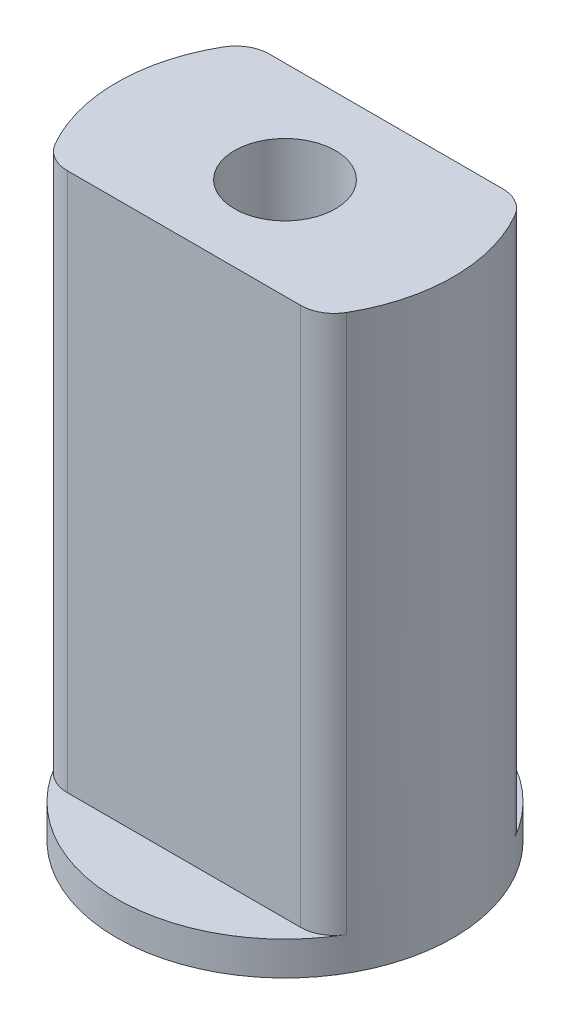
ISO-10303-21;
HEADER;
FILE_DESCRIPTION(('STEP AP214'),'2;1');
FILE_NAME('part.step','',(''),(''),'','','');
FILE_SCHEMA(('AUTOMOTIVE_DESIGN { 1 0 10303 214 1 1 1 1 }'));
ENDSEC;
DATA;
#1=APPLICATION_CONTEXT('core data for automotive mechanical design processes');
#2=APPLICATION_PROTOCOL_DEFINITION('international standard','automotive_design',2000,#1);
#3=PRODUCT_CONTEXT('',#1,'mechanical');
#4=PRODUCT('Part','Part','',(#3));
#5=PRODUCT_RELATED_PRODUCT_CATEGORY('part','',(#4));
#6=PRODUCT_DEFINITION_FORMATION('','',#4);
#7=PRODUCT_DEFINITION_CONTEXT('part definition',#1,'design');
#8=PRODUCT_DEFINITION('design','',#6,#7);
#9=PRODUCT_DEFINITION_SHAPE('','',#8);
#10=(LENGTH_UNIT() NAMED_UNIT(*) SI_UNIT(.MILLI.,.METRE.));
#11=(NAMED_UNIT(*) PLANE_ANGLE_UNIT() SI_UNIT($,.RADIAN.));
#12=(NAMED_UNIT(*) SI_UNIT($,.STERADIAN.) SOLID_ANGLE_UNIT());
#13=UNCERTAINTY_MEASURE_WITH_UNIT(LENGTH_MEASURE(1.E-05),#10,'distance_accuracy_value','');
#14=(GEOMETRIC_REPRESENTATION_CONTEXT(3) GLOBAL_UNCERTAINTY_ASSIGNED_CONTEXT((#13)) GLOBAL_UNIT_ASSIGNED_CONTEXT((#10,
#11,#12)) REPRESENTATION_CONTEXT('',''));
#15=CARTESIAN_POINT('',(0.,0.,0.));
#16=DIRECTION('',(0.,0.,1.));
#17=DIRECTION('',(1.,0.,0.));
#18=AXIS2_PLACEMENT_3D('',#15,#16,#17);
#19=CARTESIAN_POINT('',(0.,0.5,0.));
#20=DIRECTION('',(0.,1.,0.));
#21=DIRECTION('',(0.,0.,1.));
#22=AXIS2_PLACEMENT_3D('',#19,#20,#21);
#23=PLANE('',#22);
#24=CARTESIAN_POINT('',(0.,0.5,0.));
#25=DIRECTION('',(0.,1.,0.));
#26=DIRECTION('',(0.,0.,1.));
#27=AXIS2_PLACEMENT_3D('',#24,#25,#26);
#28=CIRCLE('',#27,2.5);
#29=CARTESIAN_POINT('',(2.1650635094611,0.5,-1.25));
#30=VERTEX_POINT('',#29);
#31=CARTESIAN_POINT('',(-2.1650635094611,0.5,-1.25));
#32=VERTEX_POINT('',#31);
#33=EDGE_CURVE('E131',#30,#32,#28,.T.);
#34=ORIENTED_EDGE('',*,*,#33,.T.);
#35=CARTESIAN_POINT('',(-1.73205080756888,0.5,-1.));
#36=DIRECTION('',(0.,1.,0.));
#37=DIRECTION('',(0.,0.,1.));
#38=AXIS2_PLACEMENT_3D('',#35,#36,#37);
#39=CIRCLE('',#38,0.5);
#40=CARTESIAN_POINT('',(-1.73205080756888,0.5,-1.5));
#41=VERTEX_POINT('',#40);
#42=EDGE_CURVE('E160',#32,#41,#39,.F.);
#43=ORIENTED_EDGE('',*,*,#42,.T.);
#44=DIRECTION('',(1.,0.,0.));
#45=VECTOR('',#44,1.);
#46=CARTESIAN_POINT('',(0.,0.5,-1.5));
#47=LINE('',#46,#45);
#48=CARTESIAN_POINT('',(1.73205080756888,0.5,-1.5));
#49=VERTEX_POINT('',#48);
#50=EDGE_CURVE('E138',#41,#49,#47,.T.);
#51=ORIENTED_EDGE('',*,*,#50,.T.);
#52=CARTESIAN_POINT('',(1.73205080756888,0.5,-1.));
#53=DIRECTION('',(0.,1.,0.));
#54=DIRECTION('',(0.,0.,1.));
#55=AXIS2_PLACEMENT_3D('',#52,#53,#54);
#56=CIRCLE('',#55,0.5);
#57=EDGE_CURVE('E162',#49,#30,#56,.F.);
#58=ORIENTED_EDGE('',*,*,#57,.T.);
#59=EDGE_LOOP('',(#34,#43,#51,#58));
#60=FACE_BOUND('',#59,.T.);
#61=ADVANCED_FACE('F35',(#60),#23,.T.);
#62=CARTESIAN_POINT('',(0.,0.5,0.));
#63=DIRECTION('',(0.,-1.,0.));
#64=DIRECTION('',(0.,0.,-1.));
#65=AXIS2_PLACEMENT_3D('',#62,#63,#64);
#66=CYLINDRICAL_SURFACE('',#65,2.5);
#67=CARTESIAN_POINT('',(0.,8.5,0.));
#68=DIRECTION('',(0.,1.,0.));
#69=DIRECTION('',(0.,0.,1.));
#70=AXIS2_PLACEMENT_3D('',#67,#68,#69);
#71=CIRCLE('',#70,2.5);
#72=CARTESIAN_POINT('',(-2.1650635094611,8.5,-1.25));
#73=VERTEX_POINT('',#72);
#74=CARTESIAN_POINT('',(-2.1650635094611,8.5,1.25));
#75=VERTEX_POINT('',#74);
#76=EDGE_CURVE('E125',#73,#75,#71,.T.);
#77=ORIENTED_EDGE('',*,*,#76,.F.);
#78=DIRECTION('',(0.,-1.,0.));
#79=VECTOR('',#78,1.);
#80=CARTESIAN_POINT('',(-2.1650635094611,0.5,-1.25));
#81=LINE('',#80,#79);
#82=EDGE_CURVE('E129',#73,#32,#81,.T.);
#83=ORIENTED_EDGE('',*,*,#82,.T.);
#84=ORIENTED_EDGE('',*,*,#33,.F.);
#85=DIRECTION('',(0.,-1.,0.));
#86=VECTOR('',#85,1.);
#87=CARTESIAN_POINT('',(2.1650635094611,0.5,-1.25));
#88=LINE('',#87,#86);
#89=CARTESIAN_POINT('',(2.1650635094611,8.5,-1.25));
#90=VERTEX_POINT('',#89);
#91=EDGE_CURVE('E122',#30,#90,#88,.F.);
#92=ORIENTED_EDGE('',*,*,#91,.T.);
#93=CARTESIAN_POINT('',(2.1650635094611,8.5,1.25));
#94=VERTEX_POINT('',#93);
#95=EDGE_CURVE('E105',#94,#90,#71,.T.);
#96=ORIENTED_EDGE('',*,*,#95,.F.);
#97=DIRECTION('',(0.,-1.,0.));
#98=VECTOR('',#97,1.);
#99=CARTESIAN_POINT('',(2.1650635094611,0.5,1.25));
#100=LINE('',#99,#98);
#101=CARTESIAN_POINT('',(2.1650635094611,0.5,1.25));
#102=VERTEX_POINT('',#101);
#103=EDGE_CURVE('E120',#94,#102,#100,.T.);
#104=ORIENTED_EDGE('',*,*,#103,.T.);
#105=CARTESIAN_POINT('',(-2.1650635094611,0.5,1.25));
#106=VERTEX_POINT('',#105);
#107=EDGE_CURVE('E153',#106,#102,#28,.T.);
#108=ORIENTED_EDGE('',*,*,#107,.F.);
#109=DIRECTION('',(0.,-1.,0.));
#110=VECTOR('',#109,1.);
#111=CARTESIAN_POINT('',(-2.1650635094611,0.5,1.25));
#112=LINE('',#111,#110);
#113=EDGE_CURVE('E127',#106,#75,#112,.F.);
#114=ORIENTED_EDGE('',*,*,#113,.T.);
#115=EDGE_LOOP('',(#77,#83,#84,#92,#96,#104,#108,#114));
#116=FACE_BOUND('',#115,.T.);
#117=CARTESIAN_POINT('',(0.,0.,0.));
#118=DIRECTION('',(0.,1.,0.));
#119=DIRECTION('',(0.,0.,1.));
#120=AXIS2_PLACEMENT_3D('',#117,#118,#119);
#121=CIRCLE('',#120,2.5);
#122=CARTESIAN_POINT('',(0.,0.,2.5));
#123=VERTEX_POINT('',#122);
#124=EDGE_CURVE('E150',#123,#123,#121,.T.);
#125=ORIENTED_EDGE('',*,*,#124,.T.);
#126=EDGE_LOOP('',(#125));
#127=FACE_BOUND('',#126,.T.);
#128=ADVANCED_FACE('F118',(#116,#127),#66,.T.);
#129=DIRECTION('',(1.,0.,0.));
#130=VECTOR('',#129,1.);
#131=CARTESIAN_POINT('',(0.,0.5,1.5));
#132=LINE('',#131,#130);
#133=CARTESIAN_POINT('',(-1.73205080756888,0.5,1.5));
#134=VERTEX_POINT('',#133);
#135=CARTESIAN_POINT('',(1.73205080756888,0.5,1.5));
#136=VERTEX_POINT('',#135);
#137=EDGE_CURVE('E143',#134,#136,#132,.T.);
#138=ORIENTED_EDGE('',*,*,#137,.F.);
#139=CARTESIAN_POINT('',(-1.73205080756888,0.5,1.));
#140=DIRECTION('',(0.,1.,0.));
#141=DIRECTION('',(0.,0.,1.));
#142=AXIS2_PLACEMENT_3D('',#139,#140,#141);
#143=CIRCLE('',#142,0.5);
#144=EDGE_CURVE('E11',#134,#106,#143,.F.);
#145=ORIENTED_EDGE('',*,*,#144,.T.);
#146=ORIENTED_EDGE('',*,*,#107,.T.);
#147=CARTESIAN_POINT('',(1.73205080756888,0.5,1.));
#148=DIRECTION('',(0.,1.,0.));
#149=DIRECTION('',(0.,0.,1.));
#150=AXIS2_PLACEMENT_3D('',#147,#148,#149);
#151=CIRCLE('',#150,0.5);
#152=EDGE_CURVE('E43',#102,#136,#151,.F.);
#153=ORIENTED_EDGE('',*,*,#152,.T.);
#154=EDGE_LOOP('',(#138,#145,#146,#153));
#155=FACE_BOUND('',#154,.T.);
#156=ADVANCED_FACE('F209',(#155),#23,.T.);
#157=CARTESIAN_POINT('',(0.,0.,0.));
#158=DIRECTION('',(0.,1.,0.));
#159=DIRECTION('',(0.,0.,1.));
#160=AXIS2_PLACEMENT_3D('',#157,#158,#159);
#161=PLANE('',#160);
#162=ORIENTED_EDGE('',*,*,#124,.F.);
#163=EDGE_LOOP('',(#162));
#164=FACE_BOUND('',#163,.T.);
#165=ADVANCED_FACE('F217',(#164),#161,.F.);
#166=CARTESIAN_POINT('',(0.,8.5,1.5));
#167=DIRECTION('',(0.,0.,-1.));
#168=DIRECTION('',(-1.,0.,0.));
#169=AXIS2_PLACEMENT_3D('',#166,#167,#168);
#170=PLANE('',#169);
#171=ORIENTED_EDGE('',*,*,#137,.T.);
#172=DIRECTION('',(0.,-1.,0.));
#173=VECTOR('',#172,1.);
#174=CARTESIAN_POINT('',(1.73205080756888,8.5,1.5));
#175=LINE('',#174,#173);
#176=CARTESIAN_POINT('',(1.73205080756888,8.5,1.5));
#177=VERTEX_POINT('',#176);
#178=EDGE_CURVE('E169',#136,#177,#175,.F.);
#179=ORIENTED_EDGE('',*,*,#178,.T.);
#180=DIRECTION('',(1.,0.,0.));
#181=VECTOR('',#180,1.);
#182=CARTESIAN_POINT('',(0.,8.5,1.5));
#183=LINE('',#182,#181);
#184=CARTESIAN_POINT('',(-1.73205080756888,8.5,1.5));
#185=VERTEX_POINT('',#184);
#186=EDGE_CURVE('E108',#185,#177,#183,.T.);
#187=ORIENTED_EDGE('',*,*,#186,.F.);
#188=DIRECTION('',(0.,-1.,0.));
#189=VECTOR('',#188,1.);
#190=CARTESIAN_POINT('',(-1.73205080756888,8.5,1.5));
#191=LINE('',#190,#189);
#192=EDGE_CURVE('E188',#185,#134,#191,.T.);
#193=ORIENTED_EDGE('',*,*,#192,.T.);
#194=EDGE_LOOP('',(#171,#179,#187,#193));
#195=FACE_BOUND('',#194,.T.);
#196=ADVANCED_FACE('F191',(#195),#170,.F.);
#197=CARTESIAN_POINT('',(0.,8.5,0.));
#198=DIRECTION('',(0.,-1.,0.));
#199=DIRECTION('',(0.,0.,-1.));
#200=AXIS2_PLACEMENT_3D('',#197,#198,#199);
#201=CYLINDRICAL_SURFACE('',#200,0.75);
#202=CARTESIAN_POINT('',(0.,8.5,0.));
#203=DIRECTION('',(0.,1.,0.));
#204=DIRECTION('',(0.,0.,1.));
#205=AXIS2_PLACEMENT_3D('',#202,#203,#204);
#206=CIRCLE('',#205,0.75);
#207=CARTESIAN_POINT('',(0.,8.5,0.75));
#208=VERTEX_POINT('',#207);
#209=EDGE_CURVE('E142',#208,#208,#206,.T.);
#210=ORIENTED_EDGE('',*,*,#209,.T.);
#211=EDGE_LOOP('',(#210));
#212=FACE_BOUND('',#211,.T.);
#213=CARTESIAN_POINT('',(0.,0.5,0.));
#214=DIRECTION('',(0.,1.,0.));
#215=DIRECTION('',(0.,0.,1.));
#216=AXIS2_PLACEMENT_3D('',#213,#214,#215);
#217=CIRCLE('',#216,0.75);
#218=CARTESIAN_POINT('',(0.,0.5,0.75));
#219=VERTEX_POINT('',#218);
#220=EDGE_CURVE('E178',#219,#219,#217,.T.);
#221=ORIENTED_EDGE('',*,*,#220,.F.);
#222=EDGE_LOOP('',(#221));
#223=FACE_BOUND('',#222,.T.);
#224=ADVANCED_FACE('F227',(#212,#223),#201,.F.);
#225=CARTESIAN_POINT('',(0.,8.5,-1.5));
#226=DIRECTION('',(0.,0.,-1.));
#227=DIRECTION('',(-1.,0.,0.));
#228=AXIS2_PLACEMENT_3D('',#225,#226,#227);
#229=PLANE('',#228);
#230=ORIENTED_EDGE('',*,*,#50,.F.);
#231=DIRECTION('',(0.,1.,0.));
#232=VECTOR('',#231,1.);
#233=CARTESIAN_POINT('',(-1.73205080756888,8.5,-1.5));
#234=LINE('',#233,#232);
#235=CARTESIAN_POINT('',(-1.73205080756888,8.5,-1.5));
#236=VERTEX_POINT('',#235);
#237=EDGE_CURVE('E168',#41,#236,#234,.T.);
#238=ORIENTED_EDGE('',*,*,#237,.T.);
#239=DIRECTION('',(1.,0.,0.));
#240=VECTOR('',#239,1.);
#241=CARTESIAN_POINT('',(0.,8.5,-1.5));
#242=LINE('',#241,#240);
#243=CARTESIAN_POINT('',(1.73205080756888,8.5,-1.5));
#244=VERTEX_POINT('',#243);
#245=EDGE_CURVE('E123',#236,#244,#242,.T.);
#246=ORIENTED_EDGE('',*,*,#245,.T.);
#247=DIRECTION('',(0.,1.,0.));
#248=VECTOR('',#247,1.);
#249=CARTESIAN_POINT('',(1.73205080756888,0.5,-1.5));
#250=LINE('',#249,#248);
#251=EDGE_CURVE('E137',#244,#49,#250,.F.);
#252=ORIENTED_EDGE('',*,*,#251,.T.);
#253=EDGE_LOOP('',(#230,#238,#246,#252));
#254=FACE_BOUND('',#253,.T.);
#255=ADVANCED_FACE('F196',(#254),#229,.T.);
#256=CARTESIAN_POINT('',(0.,8.5,0.));
#257=DIRECTION('',(0.,1.,0.));
#258=DIRECTION('',(0.,0.,1.));
#259=AXIS2_PLACEMENT_3D('',#256,#257,#258);
#260=PLANE('',#259);
#261=ORIENTED_EDGE('',*,*,#209,.F.);
#262=EDGE_LOOP('',(#261));
#263=FACE_BOUND('',#262,.T.);
#264=ORIENTED_EDGE('',*,*,#245,.F.);
#265=CARTESIAN_POINT('',(-1.73205080756888,8.5,-1.));
#266=DIRECTION('',(0.,1.,0.));
#267=DIRECTION('',(0.,0.,1.));
#268=AXIS2_PLACEMENT_3D('',#265,#266,#267);
#269=CIRCLE('',#268,0.5);
#270=EDGE_CURVE('E186',#236,#73,#269,.T.);
#271=ORIENTED_EDGE('',*,*,#270,.T.);
#272=ORIENTED_EDGE('',*,*,#76,.T.);
#273=CARTESIAN_POINT('',(-1.73205080756888,8.5,1.));
#274=DIRECTION('',(0.,1.,0.));
#275=DIRECTION('',(0.,0.,1.));
#276=AXIS2_PLACEMENT_3D('',#273,#274,#275);
#277=CIRCLE('',#276,0.5);
#278=EDGE_CURVE('E113',#75,#185,#277,.T.);
#279=ORIENTED_EDGE('',*,*,#278,.T.);
#280=ORIENTED_EDGE('',*,*,#186,.T.);
#281=CARTESIAN_POINT('',(1.73205080756888,8.5,1.));
#282=DIRECTION('',(0.,1.,0.));
#283=DIRECTION('',(0.,0.,1.));
#284=AXIS2_PLACEMENT_3D('',#281,#282,#283);
#285=CIRCLE('',#284,0.5);
#286=EDGE_CURVE('E101',#177,#94,#285,.T.);
#287=ORIENTED_EDGE('',*,*,#286,.T.);
#288=ORIENTED_EDGE('',*,*,#95,.T.);
#289=CARTESIAN_POINT('',(1.73205080756888,8.5,-1.));
#290=DIRECTION('',(0.,1.,0.));
#291=DIRECTION('',(0.,0.,1.));
#292=AXIS2_PLACEMENT_3D('',#289,#290,#291);
#293=CIRCLE('',#292,0.5);
#294=EDGE_CURVE('E112',#90,#244,#293,.T.);
#295=ORIENTED_EDGE('',*,*,#294,.T.);
#296=EDGE_LOOP('',(#264,#271,#272,#279,#280,#287,#288,#295));
#297=FACE_BOUND('',#296,.T.);
#298=ADVANCED_FACE('F104',(#263,#297),#260,.T.);
#299=ORIENTED_EDGE('',*,*,#220,.T.);
#300=EDGE_LOOP('',(#299));
#301=FACE_BOUND('',#300,.T.);
#302=ADVANCED_FACE('F205',(#301),#23,.T.);
#303=CARTESIAN_POINT('',(-1.73205080756888,0.5,-1.));
#304=DIRECTION('',(0.,-1.,0.));
#305=DIRECTION('',(0.,0.,-1.));
#306=AXIS2_PLACEMENT_3D('',#303,#304,#305);
#307=CYLINDRICAL_SURFACE('',#306,0.5);
#308=ORIENTED_EDGE('',*,*,#270,.F.);
#309=ORIENTED_EDGE('',*,*,#237,.F.);
#310=ORIENTED_EDGE('',*,*,#42,.F.);
#311=ORIENTED_EDGE('',*,*,#82,.F.);
#312=EDGE_LOOP('',(#308,#309,#310,#311));
#313=FACE_BOUND('',#312,.T.);
#314=ADVANCED_FACE('F167',(#313),#307,.T.);
#315=CARTESIAN_POINT('',(1.73205080756888,0.5,-1.));
#316=DIRECTION('',(0.,-1.,0.));
#317=DIRECTION('',(0.,0.,-1.));
#318=AXIS2_PLACEMENT_3D('',#315,#316,#317);
#319=CYLINDRICAL_SURFACE('',#318,0.5);
#320=ORIENTED_EDGE('',*,*,#294,.F.);
#321=ORIENTED_EDGE('',*,*,#91,.F.);
#322=ORIENTED_EDGE('',*,*,#57,.F.);
#323=ORIENTED_EDGE('',*,*,#251,.F.);
#324=EDGE_LOOP('',(#320,#321,#322,#323));
#325=FACE_BOUND('',#324,.T.);
#326=ADVANCED_FACE('F198',(#325),#319,.T.);
#327=CARTESIAN_POINT('',(1.73205080756888,0.5,1.));
#328=DIRECTION('',(0.,-1.,0.));
#329=DIRECTION('',(0.,0.,-1.));
#330=AXIS2_PLACEMENT_3D('',#327,#328,#329);
#331=CYLINDRICAL_SURFACE('',#330,0.5);
#332=ORIENTED_EDGE('',*,*,#286,.F.);
#333=ORIENTED_EDGE('',*,*,#178,.F.);
#334=ORIENTED_EDGE('',*,*,#152,.F.);
#335=ORIENTED_EDGE('',*,*,#103,.F.);
#336=EDGE_LOOP('',(#332,#333,#334,#335));
#337=FACE_BOUND('',#336,.T.);
#338=ADVANCED_FACE('F126',(#337),#331,.T.);
#339=CARTESIAN_POINT('',(-1.73205080756888,0.5,1.));
#340=DIRECTION('',(0.,-1.,0.));
#341=DIRECTION('',(0.,0.,-1.));
#342=AXIS2_PLACEMENT_3D('',#339,#340,#341);
#343=CYLINDRICAL_SURFACE('',#342,0.5);
#344=ORIENTED_EDGE('',*,*,#278,.F.);
#345=ORIENTED_EDGE('',*,*,#113,.F.);
#346=ORIENTED_EDGE('',*,*,#144,.F.);
#347=ORIENTED_EDGE('',*,*,#192,.F.);
#348=EDGE_LOOP('',(#344,#345,#346,#347));
#349=FACE_BOUND('',#348,.T.);
#350=ADVANCED_FACE('F37',(#349),#343,.T.);
#351=CLOSED_SHELL('',(#61,#128,#156,#165,#196,#224,#255,#298,#302,#314,#326,#338,#350));
#352=MANIFOLD_SOLID_BREP('B2',#351);
#353=ADVANCED_BREP_SHAPE_REPRESENTATION('',(#18,#352),#14);
#354=SHAPE_DEFINITION_REPRESENTATION(#9,#353);
ENDSEC;
END-ISO-10303-21;
